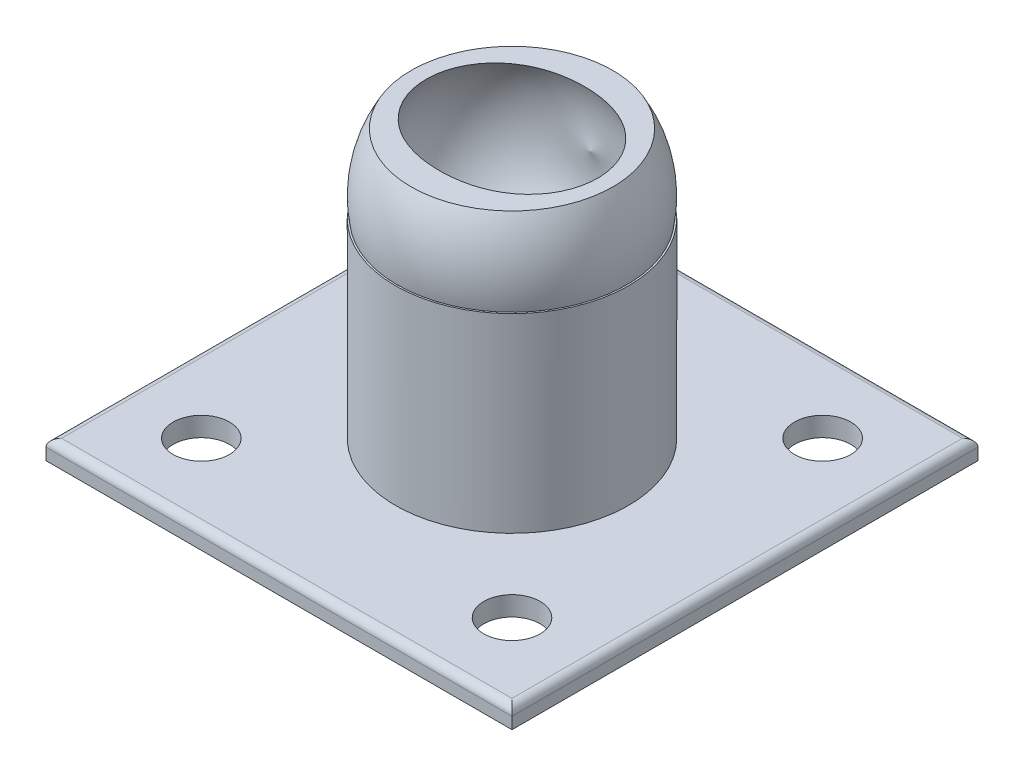
ISO-10303-21;
HEADER;
FILE_DESCRIPTION(('STEP AP214'),'2;1');
FILE_NAME('part.step','',(''),(''),'','','');
FILE_SCHEMA(('AUTOMOTIVE_DESIGN { 1 0 10303 214 1 1 1 1 }'));
ENDSEC;
DATA;
#1=APPLICATION_CONTEXT('core data for automotive mechanical design processes');
#2=APPLICATION_PROTOCOL_DEFINITION('international standard','automotive_design',2000,#1);
#3=PRODUCT_CONTEXT('',#1,'mechanical');
#4=PRODUCT('Part','Part','',(#3));
#5=PRODUCT_RELATED_PRODUCT_CATEGORY('part','',(#4));
#6=PRODUCT_DEFINITION_FORMATION('','',#4);
#7=PRODUCT_DEFINITION_CONTEXT('part definition',#1,'design');
#8=PRODUCT_DEFINITION('design','',#6,#7);
#9=PRODUCT_DEFINITION_SHAPE('','',#8);
#10=(LENGTH_UNIT() NAMED_UNIT(*) SI_UNIT(.MILLI.,.METRE.));
#11=(NAMED_UNIT(*) PLANE_ANGLE_UNIT() SI_UNIT($,.RADIAN.));
#12=(NAMED_UNIT(*) SI_UNIT($,.STERADIAN.) SOLID_ANGLE_UNIT());
#13=UNCERTAINTY_MEASURE_WITH_UNIT(LENGTH_MEASURE(1.E-05),#10,'distance_accuracy_value','');
#14=(GEOMETRIC_REPRESENTATION_CONTEXT(3) GLOBAL_UNCERTAINTY_ASSIGNED_CONTEXT((#13)) GLOBAL_UNIT_ASSIGNED_CONTEXT((#10,
#11,#12)) REPRESENTATION_CONTEXT('',''));
#15=CARTESIAN_POINT('',(0.,0.,0.));
#16=DIRECTION('',(0.,0.,1.));
#17=DIRECTION('',(1.,0.,0.));
#18=AXIS2_PLACEMENT_3D('',#15,#16,#17);
#19=CARTESIAN_POINT('',(0.,59.0365137320334,-3.49148133884313E-12));
#20=DIRECTION('',(0.,0.,-1.));
#21=DIRECTION('',(0.,-1.,0.));
#22=AXIS2_PLACEMENT_3D('',#19,#20,#21);
#23=SPHERICAL_SURFACE('',#22,30.);
#24=CARTESIAN_POINT('',(0.,59.0365137320334,-3.49148133884313E-12));
#25=DIRECTION('',(0.,1.,0.));
#26=DIRECTION('',(0.,0.,1.));
#27=AXIS2_PLACEMENT_3D('',#24,#25,#26);
#28=SPHERICAL_SURFACE('',#27,30.);
#29=CARTESIAN_POINT('',(0.,54.,-3.49148133884313E-12));
#30=DIRECTION('',(0.,1.,0.));
#31=DIRECTION('',(0.,0.,1.));
#32=AXIS2_PLACEMENT_3D('',#29,#30,#31);
#33=CIRCLE('',#32,29.574203783484);
#34=CARTESIAN_POINT('',(0.,54.,29.5742037834805));
#35=VERTEX_POINT('',#34);
#36=EDGE_CURVE('E499',#35,#35,#33,.F.);
#37=ORIENTED_EDGE('',*,*,#36,.F.);
#38=EDGE_LOOP('',(#37));
#39=FACE_BOUND('',#38,.T.);
#40=CARTESIAN_POINT('',(0.,74.0471450811481,-3.49148133884313E-12));
#41=DIRECTION('',(0.,1.,0.));
#42=DIRECTION('',(0.,0.,1.));
#43=AXIS2_PLACEMENT_3D('',#40,#41,#42);
#44=CIRCLE('',#43,25.9746212003366);
#45=CARTESIAN_POINT('',(0.,74.0471450811481,25.9746212003331));
#46=VERTEX_POINT('',#45);
#47=EDGE_CURVE('E497',#46,#46,#44,.T.);
#48=ORIENTED_EDGE('',*,*,#47,.F.);
#49=EDGE_LOOP('',(#48));
#50=FACE_BOUND('',#49,.T.);
#51=ADVANCED_FACE('F425',(#39,#50),#28,.T.);
#52=CARTESIAN_POINT('',(0.,5.,0.));
#53=DIRECTION('',(0.,-1.,0.));
#54=DIRECTION('',(0.,0.,-1.));
#55=AXIS2_PLACEMENT_3D('',#52,#53,#54);
#56=PLANE('',#55);
#57=CARTESIAN_POINT('',(0.,5.,0.));
#58=DIRECTION('',(0.,-1.,0.));
#59=DIRECTION('',(0.,0.,-1.));
#60=AXIS2_PLACEMENT_3D('',#57,#58,#59);
#61=CIRCLE('',#60,30.);
#62=CARTESIAN_POINT('',(0.,5.,-30.));
#63=VERTEX_POINT('',#62);
#64=EDGE_CURVE('E12',#63,#63,#61,.F.);
#65=ORIENTED_EDGE('',*,*,#64,.F.);
#66=EDGE_LOOP('',(#65));
#67=FACE_BOUND('',#66,.T.);
#68=DIRECTION('',(1.,0.,0.));
#69=VECTOR('',#68,1.);
#70=CARTESIAN_POINT('',(0.,5.,58.));
#71=LINE('',#70,#69);
#72=CARTESIAN_POINT('',(-58.,5.,58.));
#73=VERTEX_POINT('',#72);
#74=CARTESIAN_POINT('',(58.,5.,58.));
#75=VERTEX_POINT('',#74);
#76=EDGE_CURVE('E554',#73,#75,#71,.T.);
#77=ORIENTED_EDGE('',*,*,#76,.T.);
#78=DIRECTION('',(0.,0.,-1.));
#79=VECTOR('',#78,1.);
#80=CARTESIAN_POINT('',(58.,5.,0.));
#81=LINE('',#80,#79);
#82=CARTESIAN_POINT('',(58.,5.,-58.));
#83=VERTEX_POINT('',#82);
#84=EDGE_CURVE('E560',#75,#83,#81,.T.);
#85=ORIENTED_EDGE('',*,*,#84,.T.);
#86=DIRECTION('',(-1.,0.,0.));
#87=VECTOR('',#86,1.);
#88=CARTESIAN_POINT('',(0.,5.,-58.));
#89=LINE('',#88,#87);
#90=CARTESIAN_POINT('',(-58.,5.,-58.));
#91=VERTEX_POINT('',#90);
#92=EDGE_CURVE('E558',#83,#91,#89,.T.);
#93=ORIENTED_EDGE('',*,*,#92,.T.);
#94=DIRECTION('',(0.,0.,1.));
#95=VECTOR('',#94,1.);
#96=CARTESIAN_POINT('',(-58.,5.,0.));
#97=LINE('',#96,#95);
#98=EDGE_CURVE('E556',#91,#73,#97,.T.);
#99=ORIENTED_EDGE('',*,*,#98,.T.);
#100=EDGE_LOOP('',(#77,#85,#93,#99));
#101=FACE_BOUND('',#100,.T.);
#102=CARTESIAN_POINT('',(-40.,5.,-40.));
#103=DIRECTION('',(0.,1.,0.));
#104=DIRECTION('',(0.,0.,1.));
#105=AXIS2_PLACEMENT_3D('',#102,#103,#104);
#106=CIRCLE('',#105,7.25);
#107=CARTESIAN_POINT('',(-40.,5.,-32.75));
#108=VERTEX_POINT('',#107);
#109=EDGE_CURVE('E520',#108,#108,#106,.T.);
#110=ORIENTED_EDGE('',*,*,#109,.F.);
#111=EDGE_LOOP('',(#110));
#112=FACE_BOUND('',#111,.T.);
#113=CARTESIAN_POINT('',(39.9999999999997,5.,40.0000000000004));
#114=DIRECTION('',(0.,1.,0.));
#115=DIRECTION('',(0.,0.,1.));
#116=AXIS2_PLACEMENT_3D('',#113,#114,#115);
#117=CIRCLE('',#116,7.25000000000001);
#118=CARTESIAN_POINT('',(39.9999999999997,5.,47.2500000000004));
#119=VERTEX_POINT('',#118);
#120=EDGE_CURVE('E509',#119,#119,#117,.T.);
#121=ORIENTED_EDGE('',*,*,#120,.F.);
#122=EDGE_LOOP('',(#121));
#123=FACE_BOUND('',#122,.T.);
#124=CARTESIAN_POINT('',(-40.,5.,40.));
#125=DIRECTION('',(0.,1.,0.));
#126=DIRECTION('',(0.,0.,-1.));
#127=AXIS2_PLACEMENT_3D('',#124,#125,#126);
#128=CIRCLE('',#127,7.25);
#129=CARTESIAN_POINT('',(-40.,5.,32.75));
#130=VERTEX_POINT('',#129);
#131=EDGE_CURVE('E524',#130,#130,#128,.T.);
#132=ORIENTED_EDGE('',*,*,#131,.F.);
#133=EDGE_LOOP('',(#132));
#134=FACE_BOUND('',#133,.T.);
#135=CARTESIAN_POINT('',(39.9999999999997,5.,-40.0000000000004));
#136=DIRECTION('',(0.,1.,0.));
#137=DIRECTION('',(0.,0.,-1.));
#138=AXIS2_PLACEMENT_3D('',#135,#136,#137);
#139=CIRCLE('',#138,7.25000000000001);
#140=CARTESIAN_POINT('',(39.9999999999997,5.,-47.2500000000004));
#141=VERTEX_POINT('',#140);
#142=EDGE_CURVE('E517',#141,#141,#139,.T.);
#143=ORIENTED_EDGE('',*,*,#142,.F.);
#144=EDGE_LOOP('',(#143));
#145=FACE_BOUND('',#144,.T.);
#146=ADVANCED_FACE('F602',(#67,#101,#112,#123,#134,#145),#56,.F.);
#147=CARTESIAN_POINT('',(0.,0.,0.));
#148=DIRECTION('',(0.,-1.,0.));
#149=DIRECTION('',(0.,0.,-1.));
#150=AXIS2_PLACEMENT_3D('',#147,#148,#149);
#151=PLANE('',#150);
#152=CARTESIAN_POINT('',(-40.,0.,40.));
#153=DIRECTION('',(0.,1.,0.));
#154=DIRECTION('',(0.,0.,-1.));
#155=AXIS2_PLACEMENT_3D('',#152,#153,#154);
#156=CIRCLE('',#155,7.25);
#157=CARTESIAN_POINT('',(-40.,0.,32.75));
#158=VERTEX_POINT('',#157);
#159=EDGE_CURVE('E512',#158,#158,#156,.T.);
#160=ORIENTED_EDGE('',*,*,#159,.T.);
#161=EDGE_LOOP('',(#160));
#162=FACE_BOUND('',#161,.T.);
#163=DIRECTION('',(0.,0.,1.));
#164=VECTOR('',#163,1.);
#165=CARTESIAN_POINT('',(-60.,0.,-60.));
#166=LINE('',#165,#164);
#167=CARTESIAN_POINT('',(-60.,0.,-60.));
#168=VERTEX_POINT('',#167);
#169=CARTESIAN_POINT('',(-60.,0.,60.));
#170=VERTEX_POINT('',#169);
#171=EDGE_CURVE('E532',#168,#170,#166,.T.);
#172=ORIENTED_EDGE('',*,*,#171,.F.);
#173=DIRECTION('',(-1.,0.,0.));
#174=VECTOR('',#173,1.);
#175=CARTESIAN_POINT('',(60.,0.,-60.));
#176=LINE('',#175,#174);
#177=CARTESIAN_POINT('',(60.,0.,-60.));
#178=VERTEX_POINT('',#177);
#179=EDGE_CURVE('E543',#178,#168,#176,.T.);
#180=ORIENTED_EDGE('',*,*,#179,.F.);
#181=DIRECTION('',(0.,0.,-1.));
#182=VECTOR('',#181,1.);
#183=CARTESIAN_POINT('',(60.,0.,-60.));
#184=LINE('',#183,#182);
#185=CARTESIAN_POINT('',(60.,0.,60.));
#186=VERTEX_POINT('',#185);
#187=EDGE_CURVE('E540',#186,#178,#184,.T.);
#188=ORIENTED_EDGE('',*,*,#187,.F.);
#189=DIRECTION('',(1.,0.,0.));
#190=VECTOR('',#189,1.);
#191=CARTESIAN_POINT('',(60.,0.,60.));
#192=LINE('',#191,#190);
#193=EDGE_CURVE('E537',#170,#186,#192,.T.);
#194=ORIENTED_EDGE('',*,*,#193,.F.);
#195=EDGE_LOOP('',(#172,#180,#188,#194));
#196=FACE_BOUND('',#195,.T.);
#197=CARTESIAN_POINT('',(-40.,0.,-40.));
#198=DIRECTION('',(0.,1.,0.));
#199=DIRECTION('',(0.,0.,1.));
#200=AXIS2_PLACEMENT_3D('',#197,#198,#199);
#201=CIRCLE('',#200,7.25);
#202=CARTESIAN_POINT('',(-40.,0.,-32.75));
#203=VERTEX_POINT('',#202);
#204=EDGE_CURVE('E529',#203,#203,#201,.T.);
#205=ORIENTED_EDGE('',*,*,#204,.T.);
#206=EDGE_LOOP('',(#205));
#207=FACE_BOUND('',#206,.T.);
#208=CARTESIAN_POINT('',(39.9999999999997,0.,40.0000000000004));
#209=DIRECTION('',(0.,1.,0.));
#210=DIRECTION('',(0.,0.,1.));
#211=AXIS2_PLACEMENT_3D('',#208,#209,#210);
#212=CIRCLE('',#211,7.25000000000001);
#213=CARTESIAN_POINT('',(39.9999999999997,0.,47.2500000000004));
#214=VERTEX_POINT('',#213);
#215=EDGE_CURVE('E513',#214,#214,#212,.T.);
#216=ORIENTED_EDGE('',*,*,#215,.T.);
#217=EDGE_LOOP('',(#216));
#218=FACE_BOUND('',#217,.T.);
#219=CARTESIAN_POINT('',(39.9999999999997,0.,-40.0000000000004));
#220=DIRECTION('',(0.,1.,0.));
#221=DIRECTION('',(0.,0.,-1.));
#222=AXIS2_PLACEMENT_3D('',#219,#220,#221);
#223=CIRCLE('',#222,7.25000000000001);
#224=CARTESIAN_POINT('',(39.9999999999997,0.,-47.2500000000004));
#225=VERTEX_POINT('',#224);
#226=EDGE_CURVE('E521',#225,#225,#223,.T.);
#227=ORIENTED_EDGE('',*,*,#226,.T.);
#228=EDGE_LOOP('',(#227));
#229=FACE_BOUND('',#228,.T.);
#230=ADVANCED_FACE('F605',(#162,#196,#207,#218,#229),#151,.T.);
#231=CARTESIAN_POINT('',(-60.,5.,-60.));
#232=DIRECTION('',(1.,0.,0.));
#233=DIRECTION('',(0.,0.,-1.));
#234=AXIS2_PLACEMENT_3D('',#231,#232,#233);
#235=PLANE('',#234);
#236=DIRECTION('',(0.,-1.,0.));
#237=VECTOR('',#236,1.);
#238=CARTESIAN_POINT('',(-60.,5.,60.));
#239=LINE('',#238,#237);
#240=CARTESIAN_POINT('',(-60.,3.,60.));
#241=VERTEX_POINT('',#240);
#242=EDGE_CURVE('E552',#241,#170,#239,.T.);
#243=ORIENTED_EDGE('',*,*,#242,.F.);
#244=DIRECTION('',(0.,0.,1.));
#245=VECTOR('',#244,1.);
#246=CARTESIAN_POINT('',(-60.,3.,-60.));
#247=LINE('',#246,#245);
#248=CARTESIAN_POINT('',(-60.,3.,-60.));
#249=VERTEX_POINT('',#248);
#250=EDGE_CURVE('E453',#241,#249,#247,.F.);
#251=ORIENTED_EDGE('',*,*,#250,.T.);
#252=DIRECTION('',(0.,-1.,0.));
#253=VECTOR('',#252,1.);
#254=CARTESIAN_POINT('',(-60.,5.,-60.));
#255=LINE('',#254,#253);
#256=EDGE_CURVE('E546',#249,#168,#255,.T.);
#257=ORIENTED_EDGE('',*,*,#256,.T.);
#258=ORIENTED_EDGE('',*,*,#171,.T.);
#259=EDGE_LOOP('',(#243,#251,#257,#258));
#260=FACE_BOUND('',#259,.T.);
#261=ADVANCED_FACE('F624',(#260),#235,.F.);
#262=CARTESIAN_POINT('',(60.,5.,60.));
#263=DIRECTION('',(0.,0.,-1.));
#264=DIRECTION('',(-1.,0.,0.));
#265=AXIS2_PLACEMENT_3D('',#262,#263,#264);
#266=PLANE('',#265);
#267=DIRECTION('',(0.,-1.,0.));
#268=VECTOR('',#267,1.);
#269=CARTESIAN_POINT('',(60.,5.,60.));
#270=LINE('',#269,#268);
#271=CARTESIAN_POINT('',(60.,3.,60.));
#272=VERTEX_POINT('',#271);
#273=EDGE_CURVE('E550',#272,#186,#270,.T.);
#274=ORIENTED_EDGE('',*,*,#273,.F.);
#275=DIRECTION('',(1.,0.,0.));
#276=VECTOR('',#275,1.);
#277=CARTESIAN_POINT('',(60.,3.,60.));
#278=LINE('',#277,#276);
#279=EDGE_CURVE('E439',#272,#241,#278,.F.);
#280=ORIENTED_EDGE('',*,*,#279,.T.);
#281=ORIENTED_EDGE('',*,*,#242,.T.);
#282=ORIENTED_EDGE('',*,*,#193,.T.);
#283=EDGE_LOOP('',(#274,#280,#281,#282));
#284=FACE_BOUND('',#283,.T.);
#285=ADVANCED_FACE('F630',(#284),#266,.F.);
#286=CARTESIAN_POINT('',(60.,5.,-60.));
#287=DIRECTION('',(-1.,0.,0.));
#288=DIRECTION('',(0.,0.,1.));
#289=AXIS2_PLACEMENT_3D('',#286,#287,#288);
#290=PLANE('',#289);
#291=DIRECTION('',(0.,-1.,0.));
#292=VECTOR('',#291,1.);
#293=CARTESIAN_POINT('',(60.,5.,-60.));
#294=LINE('',#293,#292);
#295=CARTESIAN_POINT('',(60.,3.,-60.));
#296=VERTEX_POINT('',#295);
#297=EDGE_CURVE('E548',#296,#178,#294,.T.);
#298=ORIENTED_EDGE('',*,*,#297,.F.);
#299=DIRECTION('',(0.,0.,-1.));
#300=VECTOR('',#299,1.);
#301=CARTESIAN_POINT('',(60.,3.,-60.));
#302=LINE('',#301,#300);
#303=EDGE_CURVE('E563',#296,#272,#302,.F.);
#304=ORIENTED_EDGE('',*,*,#303,.T.);
#305=ORIENTED_EDGE('',*,*,#273,.T.);
#306=ORIENTED_EDGE('',*,*,#187,.T.);
#307=EDGE_LOOP('',(#298,#304,#305,#306));
#308=FACE_BOUND('',#307,.T.);
#309=ADVANCED_FACE('F595',(#308),#290,.F.);
#310=CARTESIAN_POINT('',(60.,5.,-60.));
#311=DIRECTION('',(0.,0.,1.));
#312=DIRECTION('',(1.,0.,0.));
#313=AXIS2_PLACEMENT_3D('',#310,#311,#312);
#314=PLANE('',#313);
#315=ORIENTED_EDGE('',*,*,#256,.F.);
#316=DIRECTION('',(-1.,0.,0.));
#317=VECTOR('',#316,1.);
#318=CARTESIAN_POINT('',(60.,3.,-60.));
#319=LINE('',#318,#317);
#320=EDGE_CURVE('E566',#249,#296,#319,.F.);
#321=ORIENTED_EDGE('',*,*,#320,.T.);
#322=ORIENTED_EDGE('',*,*,#297,.T.);
#323=ORIENTED_EDGE('',*,*,#179,.T.);
#324=EDGE_LOOP('',(#315,#321,#322,#323));
#325=FACE_BOUND('',#324,.T.);
#326=ADVANCED_FACE('F592',(#325),#314,.F.);
#327=CARTESIAN_POINT('',(-40.,0.,-40.));
#328=DIRECTION('',(0.,1.,0.));
#329=DIRECTION('',(0.,0.,1.));
#330=AXIS2_PLACEMENT_3D('',#327,#328,#329);
#331=CYLINDRICAL_SURFACE('',#330,7.25);
#332=ORIENTED_EDGE('',*,*,#204,.F.);
#333=EDGE_LOOP('',(#332));
#334=FACE_BOUND('',#333,.T.);
#335=ORIENTED_EDGE('',*,*,#109,.T.);
#336=EDGE_LOOP('',(#335));
#337=FACE_BOUND('',#336,.T.);
#338=ADVANCED_FACE('F653',(#334,#337),#331,.F.);
#339=CARTESIAN_POINT('',(39.9999999999997,5.,40.0000000000004));
#340=DIRECTION('',(0.,-1.,0.));
#341=DIRECTION('',(0.,0.,-1.));
#342=AXIS2_PLACEMENT_3D('',#339,#340,#341);
#343=CYLINDRICAL_SURFACE('',#342,7.25000000000001);
#344=ORIENTED_EDGE('',*,*,#120,.T.);
#345=EDGE_LOOP('',(#344));
#346=FACE_BOUND('',#345,.T.);
#347=ORIENTED_EDGE('',*,*,#215,.F.);
#348=EDGE_LOOP('',(#347));
#349=FACE_BOUND('',#348,.T.);
#350=ADVANCED_FACE('F651',(#346,#349),#343,.F.);
#351=CARTESIAN_POINT('',(-40.,5.,40.));
#352=DIRECTION('',(0.,-1.,0.));
#353=DIRECTION('',(0.,0.,-1.));
#354=AXIS2_PLACEMENT_3D('',#351,#352,#353);
#355=CYLINDRICAL_SURFACE('',#354,7.25);
#356=ORIENTED_EDGE('',*,*,#131,.T.);
#357=EDGE_LOOP('',(#356));
#358=FACE_BOUND('',#357,.T.);
#359=ORIENTED_EDGE('',*,*,#159,.F.);
#360=EDGE_LOOP('',(#359));
#361=FACE_BOUND('',#360,.T.);
#362=ADVANCED_FACE('F619',(#358,#361),#355,.F.);
#363=CARTESIAN_POINT('',(39.9999999999997,5.,-40.0000000000004));
#364=DIRECTION('',(0.,-1.,0.));
#365=DIRECTION('',(0.,0.,-1.));
#366=AXIS2_PLACEMENT_3D('',#363,#364,#365);
#367=CYLINDRICAL_SURFACE('',#366,7.25000000000001);
#368=ORIENTED_EDGE('',*,*,#142,.T.);
#369=EDGE_LOOP('',(#368));
#370=FACE_BOUND('',#369,.T.);
#371=ORIENTED_EDGE('',*,*,#226,.F.);
#372=EDGE_LOOP('',(#371));
#373=FACE_BOUND('',#372,.T.);
#374=ADVANCED_FACE('F616',(#370,#373),#367,.F.);
#375=CARTESIAN_POINT('',(-58.,3.,0.));
#376=DIRECTION('',(0.,0.,1.));
#377=DIRECTION('',(1.,0.,0.));
#378=AXIS2_PLACEMENT_3D('',#375,#376,#377);
#379=CYLINDRICAL_SURFACE('',#378,2.);
#380=CARTESIAN_POINT('',(-58.,3.,-58.));
#381=DIRECTION('',(-0.707106781186547,0.,0.707106781186548));
#382=DIRECTION('',(0.707106781186548,0.,0.707106781186547));
#383=AXIS2_PLACEMENT_3D('',#380,#381,#382);
#384=ELLIPSE('',#383,2.82842712474619,2.);
#385=EDGE_CURVE('E573',#249,#91,#384,.F.);
#386=ORIENTED_EDGE('',*,*,#385,.F.);
#387=ORIENTED_EDGE('',*,*,#250,.F.);
#388=CARTESIAN_POINT('',(-58.,3.,58.));
#389=DIRECTION('',(0.707106781186548,0.,0.707106781186547));
#390=DIRECTION('',(0.707106781186547,0.,-0.707106781186548));
#391=AXIS2_PLACEMENT_3D('',#388,#389,#390);
#392=ELLIPSE('',#391,2.82842712474619,2.);
#393=EDGE_CURVE('E516',#73,#241,#392,.T.);
#394=ORIENTED_EDGE('',*,*,#393,.F.);
#395=ORIENTED_EDGE('',*,*,#98,.F.);
#396=EDGE_LOOP('',(#386,#387,#394,#395));
#397=FACE_BOUND('',#396,.T.);
#398=ADVANCED_FACE('F427',(#397),#379,.T.);
#399=CARTESIAN_POINT('',(0.,3.,58.));
#400=DIRECTION('',(1.,0.,0.));
#401=DIRECTION('',(0.,0.,-1.));
#402=AXIS2_PLACEMENT_3D('',#399,#400,#401);
#403=CYLINDRICAL_SURFACE('',#402,2.);
#404=ORIENTED_EDGE('',*,*,#393,.T.);
#405=ORIENTED_EDGE('',*,*,#279,.F.);
#406=CARTESIAN_POINT('',(58.,3.,58.));
#407=DIRECTION('',(0.707106781186547,0.,-0.707106781186548));
#408=DIRECTION('',(0.707106781186548,0.,0.707106781186547));
#409=AXIS2_PLACEMENT_3D('',#406,#407,#408);
#410=ELLIPSE('',#409,2.82842712474619,2.);
#411=EDGE_CURVE('E571',#75,#272,#410,.T.);
#412=ORIENTED_EDGE('',*,*,#411,.F.);
#413=ORIENTED_EDGE('',*,*,#76,.F.);
#414=EDGE_LOOP('',(#404,#405,#412,#413));
#415=FACE_BOUND('',#414,.T.);
#416=ADVANCED_FACE('F580',(#415),#403,.T.);
#417=CARTESIAN_POINT('',(0.,3.,-58.));
#418=DIRECTION('',(-1.,0.,0.));
#419=DIRECTION('',(0.,0.,1.));
#420=AXIS2_PLACEMENT_3D('',#417,#418,#419);
#421=CYLINDRICAL_SURFACE('',#420,2.);
#422=ORIENTED_EDGE('',*,*,#385,.T.);
#423=ORIENTED_EDGE('',*,*,#92,.F.);
#424=CARTESIAN_POINT('',(58.,3.,-58.));
#425=DIRECTION('',(-0.707106781186548,0.,-0.707106781186547));
#426=DIRECTION('',(-0.707106781186547,0.,0.707106781186548));
#427=AXIS2_PLACEMENT_3D('',#424,#425,#426);
#428=ELLIPSE('',#427,2.82842712474619,2.);
#429=EDGE_CURVE('E508',#296,#83,#428,.F.);
#430=ORIENTED_EDGE('',*,*,#429,.F.);
#431=ORIENTED_EDGE('',*,*,#320,.F.);
#432=EDGE_LOOP('',(#422,#423,#430,#431));
#433=FACE_BOUND('',#432,.T.);
#434=ADVANCED_FACE('F589',(#433),#421,.T.);
#435=CARTESIAN_POINT('',(58.,3.,0.));
#436=DIRECTION('',(0.,0.,-1.));
#437=DIRECTION('',(-1.,0.,0.));
#438=AXIS2_PLACEMENT_3D('',#435,#436,#437);
#439=CYLINDRICAL_SURFACE('',#438,2.);
#440=ORIENTED_EDGE('',*,*,#411,.T.);
#441=ORIENTED_EDGE('',*,*,#303,.F.);
#442=ORIENTED_EDGE('',*,*,#429,.T.);
#443=ORIENTED_EDGE('',*,*,#84,.F.);
#444=EDGE_LOOP('',(#440,#441,#442,#443));
#445=FACE_BOUND('',#444,.T.);
#446=ADVANCED_FACE('F599',(#445),#439,.T.);
#447=CARTESIAN_POINT('',(0.,54.,0.));
#448=DIRECTION('',(0.,-1.,0.));
#449=DIRECTION('',(0.,0.,-1.));
#450=AXIS2_PLACEMENT_3D('',#447,#448,#449);
#451=CYLINDRICAL_SURFACE('',#450,30.);
#452=CARTESIAN_POINT('',(0.,54.,0.));
#453=DIRECTION('',(0.,1.,0.));
#454=DIRECTION('',(0.,0.,1.));
#455=AXIS2_PLACEMENT_3D('',#452,#453,#454);
#456=CIRCLE('',#455,30.);
#457=CARTESIAN_POINT('',(0.,54.,30.));
#458=VERTEX_POINT('',#457);
#459=EDGE_CURVE('E504',#458,#458,#456,.T.);
#460=ORIENTED_EDGE('',*,*,#459,.F.);
#461=EDGE_LOOP('',(#460));
#462=FACE_BOUND('',#461,.T.);
#463=ORIENTED_EDGE('',*,*,#64,.T.);
#464=EDGE_LOOP('',(#463));
#465=FACE_BOUND('',#464,.T.);
#466=ADVANCED_FACE('F646',(#462,#465),#451,.T.);
#467=CARTESIAN_POINT('',(0.,54.,0.));
#468=DIRECTION('',(0.,1.,0.));
#469=DIRECTION('',(0.,0.,1.));
#470=AXIS2_PLACEMENT_3D('',#467,#468,#469);
#471=PLANE('',#470);
#472=ORIENTED_EDGE('',*,*,#36,.T.);
#473=EDGE_LOOP('',(#472));
#474=FACE_BOUND('',#473,.T.);
#475=ORIENTED_EDGE('',*,*,#459,.T.);
#476=EDGE_LOOP('',(#475));
#477=FACE_BOUND('',#476,.T.);
#478=ADVANCED_FACE('F643',(#474,#477),#471,.T.);
#479=CARTESIAN_POINT('',(29.2863577086589,74.0471450811481,49.));
#480=DIRECTION('',(0.,1.,0.));
#481=DIRECTION('',(0.,0.,1.));
#482=AXIS2_PLACEMENT_3D('',#479,#480,#481);
#483=PLANE('',#482);
#484=CARTESIAN_POINT('',(0.,74.0471450811481,-18.7271586684848));
#485=CARTESIAN_POINT('',(-0.668017020547555,74.0471450811481,-18.7271677846323));
#486=CARTESIAN_POINT('',(-1.3361612459375,74.0471450811481,-18.705448487345));
#487=CARTESIAN_POINT('',(-2.33599366753405,74.0471450811481,-18.6396788457028));
#488=CARTESIAN_POINT('',(-2.66886534171061,74.0471450811481,-18.6122249753951));
#489=CARTESIAN_POINT('',(-3.3335731781216,74.0471450811481,-18.5459806591432));
#490=CARTESIAN_POINT('',(-3.66540903593192,74.0471450811481,-18.5071871490198));
#491=CARTESIAN_POINT('',(-4.65711902089607,74.0471450811481,-18.3735503373971));
#492=CARTESIAN_POINT('',(-5.3147582076061,74.0471450811481,-18.2613508641152));
#493=CARTESIAN_POINT('',(-6.61961352969084,74.0471450811481,-17.9876728165485));
#494=CARTESIAN_POINT('',(-7.26683200516482,74.0471450811481,-17.8262054731585));
#495=CARTESIAN_POINT('',(-8.47477168951909,74.0471450811481,-17.4718789090981));
#496=CARTESIAN_POINT('',(-9.03710015597965,74.0471450811481,-17.2845165549288));
#497=CARTESIAN_POINT('',(-10.1456114711685,74.0471450811481,-16.8668127037952));
#498=CARTESIAN_POINT('',(-10.6917952898312,74.0471450811481,-16.6364737948706));
#499=CARTESIAN_POINT('',(-11.7635431604292,74.0471450811481,-16.1317583047935));
#500=CARTESIAN_POINT('',(-12.2891058627849,74.0471450811481,-15.8573788473044));
#501=CARTESIAN_POINT('',(-13.3147286834302,74.0471450811481,-15.2643737655402));
#502=CARTESIAN_POINT('',(-13.8147886107276,74.0471450811481,-14.9457478099662));
#503=CARTESIAN_POINT('',(-14.7877775649575,74.0471450811481,-14.2625489839806));
#504=CARTESIAN_POINT('',(-15.2604927697505,74.0471450811481,-13.8976708238779));
#505=CARTESIAN_POINT('',(-16.1698658654619,74.0471450811481,-13.1253480008268));
#506=CARTESIAN_POINT('',(-16.6065226473253,74.0471450811481,-12.7179020294855));
#507=CARTESIAN_POINT('',(-17.4387098316874,74.0471450811481,-11.8630712227956));
#508=CARTESIAN_POINT('',(-17.8342476814913,74.0471450811481,-11.4156936470839));
#509=CARTESIAN_POINT('',(-18.579575338605,74.0471450811481,-10.4843425860008));
#510=CARTESIAN_POINT('',(-18.9293709412479,74.0471450811481,-10.0003737488599));
#511=CARTESIAN_POINT('',(-19.54152121421,74.0471450811481,-9.05769471477934));
#512=CARTESIAN_POINT('',(-19.8093073069024,74.0471450811481,-8.60250227312526));
#513=CARTESIAN_POINT('',(-20.3031705704639,74.0471450811481,-7.67003498691809));
#514=CARTESIAN_POINT('',(-20.5292511106325,74.0471450811481,-7.19276193010915));
#515=CARTESIAN_POINT('',(-20.9373956560506,74.0471450811481,-6.21997486982651));
#516=CARTESIAN_POINT('',(-21.1194773882383,74.0471450811481,-5.72446830558735));
#517=CARTESIAN_POINT('',(-21.4379236096211,74.0471450811481,-4.71897205128857));
#518=CARTESIAN_POINT('',(-21.5742895727118,74.0471450811481,-4.20898282873108));
#519=CARTESIAN_POINT('',(-21.7928794525547,74.0471450811481,-3.21092534578783));
#520=CARTESIAN_POINT('',(-21.8779548417385,74.0471450811481,-2.72347947973877));
#521=CARTESIAN_POINT('',(-22.0059724504332,74.0471450811481,-1.74309884331178));
#522=CARTESIAN_POINT('',(-22.0489167975898,74.0471450811481,-1.25016435138471));
#523=CARTESIAN_POINT('',(-22.0922897221538,74.0471450811481,-0.262494042571195));
#524=CARTESIAN_POINT('',(-22.0927237573203,74.0471450811481,0.232241534923627));
#525=CARTESIAN_POINT('',(-22.0510861811859,74.0471450811481,1.21992293837191));
#526=CARTESIAN_POINT('',(-22.0090145814974,74.0471450811481,1.71286876481429));
#527=CARTESIAN_POINT('',(-21.8839119757449,74.0471450811481,2.6842535287685));
#528=CARTESIAN_POINT('',(-21.8016530701091,74.0471450811481,3.16279213719376));
#529=CARTESIAN_POINT('',(-21.5972594264288,74.0471450811481,4.1112649972871));
#530=CARTESIAN_POINT('',(-21.4751254315889,74.0471450811481,4.5811994091505));
#531=CARTESIAN_POINT('',(-21.1920323742269,74.0471450811481,5.50918401508695));
#532=CARTESIAN_POINT('',(-21.0310758537203,74.0471450811481,5.9672349850882));
#533=CARTESIAN_POINT('',(-20.6716952042626,74.0471450811481,6.86839083576682));
#534=CARTESIAN_POINT('',(-20.4732706674129,74.0471450811481,7.31149555366868));
#535=CARTESIAN_POINT('',(-20.03882937961,74.0471450811481,8.18344317292771));
#536=CARTESIAN_POINT('',(-19.8025157375659,74.0471450811481,8.61213809163636));
#537=CARTESIAN_POINT('',(-19.2954786451245,74.0471450811481,9.4486540068218));
#538=CARTESIAN_POINT('',(-19.0247552226644,74.0471450811481,9.85647502024582));
#539=CARTESIAN_POINT('',(-18.4510967613746,74.0471450811481,10.6488620977415));
#540=CARTESIAN_POINT('',(-18.148157341757,74.0471450811481,11.0334249879506));
#541=CARTESIAN_POINT('',(-17.512548309635,74.0471450811481,11.7771271193175));
#542=CARTESIAN_POINT('',(-17.179878019853,74.0471450811481,12.1362657809699));
#543=CARTESIAN_POINT('',(-16.4743075216509,74.0471450811481,12.8404570041919));
#544=CARTESIAN_POINT('',(-16.1003607625658,74.0471450811481,13.1844606909839));
#545=CARTESIAN_POINT('',(-15.3263427540943,74.0471450811481,13.8416619989739));
#546=CARTESIAN_POINT('',(-14.9262710709906,74.0471450811481,14.1548591085149));
#547=CARTESIAN_POINT('',(-14.1032851978508,74.0471450811481,14.7493089697509));
#548=CARTESIAN_POINT('',(-13.6803782301559,74.0471450811481,15.0305717353205));
#549=CARTESIAN_POINT('',(-12.8147608873353,74.0471450811481,15.5607185740583));
#550=CARTESIAN_POINT('',(-12.3720497447382,74.0471450811481,15.8096013909425));
#551=CARTESIAN_POINT('',(-11.4302800134914,74.0471450811481,16.2953590071756));
#552=CARTESIAN_POINT('',(-10.9296876713099,74.0471450811481,16.5292589192196));
#553=CARTESIAN_POINT('',(-9.91254608226104,74.0471450811481,16.9591802182376));
#554=CARTESIAN_POINT('',(-9.39599624256762,74.0471450811481,17.1552001959923));
#555=CARTESIAN_POINT('',(-8.34967890373035,74.0471450811481,17.5107301955213));
#556=CARTESIAN_POINT('',(-7.819893192919,74.0471450811481,17.6701864475363));
#557=CARTESIAN_POINT('',(-6.75099003461007,74.0471450811481,17.9537550576117));
#558=CARTESIAN_POINT('',(-6.21187157827271,74.0471450811481,18.077863569067));
#559=CARTESIAN_POINT('',(-4.85523398293619,74.0471450811481,18.3462692951662));
#560=CARTESIAN_POINT('',(-4.03347010953847,74.0471450811481,18.4695636255915));
#561=CARTESIAN_POINT('',(-2.79540809013505,74.0471450811481,18.601834021083));
#562=CARTESIAN_POINT('',(-2.38165623817831,74.0471450811481,18.6371491091473));
#563=CARTESIAN_POINT('',(-1.55301847927785,74.0471450811481,18.6906666226277));
#564=CARTESIAN_POINT('',(-1.13813260147991,74.0471450811481,18.7088694837765));
#565=CARTESIAN_POINT('',(-0.307516454721388,74.0471450811481,18.7284362147949));
#566=CARTESIAN_POINT('',(0.108214240235389,74.0471450811481,18.7297813497184));
#567=CARTESIAN_POINT('',(0.939399335051305,74.0471450811481,18.7156050026797));
#568=CARTESIAN_POINT('',(1.35485372936888,74.0471450811481,18.7000831920642));
#569=CARTESIAN_POINT('',(2.18462973643094,74.0471450811481,18.6519534979359));
#570=CARTESIAN_POINT('',(2.59895170715911,74.0471450811481,18.6193518501729));
#571=CARTESIAN_POINT('',(3.42580698778213,74.0471450811481,18.5366249814692));
#572=CARTESIAN_POINT('',(3.83834039384872,74.0471450811481,18.4865007148593));
#573=CARTESIAN_POINT('',(4.90240029846964,74.0471450811481,18.3333416865052));
#574=CARTESIAN_POINT('',(5.55201310922952,74.0471450811481,18.2165210994621));
#575=CARTESIAN_POINT('',(6.8406044416127,74.0471450811481,17.9342698029591));
#576=CARTESIAN_POINT('',(7.4795837016094,74.0471450811481,17.7688424836648));
#577=CARTESIAN_POINT('',(8.74039083535136,74.0471450811481,17.3869952000371));
#578=CARTESIAN_POINT('',(9.36225959011569,74.0471450811481,17.1707112155451));
#579=CARTESIAN_POINT('',(10.5848088548713,74.0471450811481,16.6847408892375));
#580=CARTESIAN_POINT('',(11.1854929306956,74.0471450811481,16.4150635856862));
#581=CARTESIAN_POINT('',(12.2615499407812,74.0471450811481,15.8707070571368));
#582=CARTESIAN_POINT('',(12.7411341435561,74.0471450811481,15.6043376303068));
#583=CARTESIAN_POINT('',(13.6772960724657,74.0471450811481,15.0338165675469));
#584=CARTESIAN_POINT('',(14.1338759720238,74.0471450811481,14.7296685103484));
#585=CARTESIAN_POINT('',(15.0202969433559,74.0471450811481,14.0841160345634));
#586=CARTESIAN_POINT('',(15.4501241628166,74.0471450811481,13.7426925629521));
#587=CARTESIAN_POINT('',(16.2788291571913,74.0471450811481,13.0240791861454));
#588=CARTESIAN_POINT('',(16.6777062678975,74.0471450811481,12.6468885137504));
#589=CARTESIAN_POINT('',(17.4422071515215,74.0471450811481,11.8571511550988));
#590=CARTESIAN_POINT('',(17.8076884328278,74.0471450811481,11.4444663377031));
#591=CARTESIAN_POINT('',(18.4998734483392,74.0471450811481,10.5877203602016));
#592=CARTESIAN_POINT('',(18.826576572456,74.0471450811481,10.1436587066263));
#593=CARTESIAN_POINT('',(19.4377350220385,74.0471450811481,9.2274965876193));
#594=CARTESIAN_POINT('',(19.7222009637048,74.0471450811481,8.75540320978936));
#595=CARTESIAN_POINT('',(20.2459591661917,74.0471450811481,7.7867984833982));
#596=CARTESIAN_POINT('',(20.4852548178632,74.0471450811481,7.29028897124137));
#597=CARTESIAN_POINT('',(20.8990686360459,74.0471450811481,6.31708222254005));
#598=CARTESIAN_POINT('',(21.0772130046635,74.0471450811481,5.84192337654425));
#599=CARTESIAN_POINT('',(21.3913899299159,74.0471450811481,4.87788934818766));
#600=CARTESIAN_POINT('',(21.5274248112092,74.0471450811481,4.38901492462225));
#601=CARTESIAN_POINT('',(21.7560970422554,74.0471450811481,3.401333181227));
#602=CARTESIAN_POINT('',(21.8487440201156,74.0471450811481,2.90252809072485));
#603=CARTESIAN_POINT('',(21.9898190893562,74.0471450811481,1.89870095213692));
#604=CARTESIAN_POINT('',(22.038247819797,74.0471450811481,1.39367899400679));
#605=CARTESIAN_POINT('',(22.0894680770334,74.0471450811481,0.400108980881151));
#606=CARTESIAN_POINT('',(22.0938842531677,74.0471450811481,-0.0883560531948876));
#607=CARTESIAN_POINT('',(22.061261828206,74.0471450811481,-1.06388925791755));
#608=CARTESIAN_POINT('',(22.0242245143022,74.0471450811481,-1.55095747146669));
#609=CARTESIAN_POINT('',(21.9090242591674,74.0471450811481,-2.52015386066545));
#610=CARTESIAN_POINT('',(21.8308653087809,74.0471450811481,-3.00228251107025));
#611=CARTESIAN_POINT('',(21.6341022167662,74.0471450811481,-3.95821396410143));
#612=CARTESIAN_POINT('',(21.5154978748376,74.0471450811481,-4.43201672548272));
#613=CARTESIAN_POINT('',(21.2395798268147,74.0471450811481,-5.36556009482438));
#614=CARTESIAN_POINT('',(21.0824679521438,74.0471450811481,-5.82536040281518));
#615=CARTESIAN_POINT('',(20.7305634113163,74.0471450811481,-6.73029512292779));
#616=CARTESIAN_POINT('',(20.5357710965002,74.0471450811481,-7.17542967175095));
#617=CARTESIAN_POINT('',(20.1101339330569,74.0471450811481,-8.04812396240864));
#618=CARTESIAN_POINT('',(19.8792877733281,74.0471450811481,-8.47568306439573));
#619=CARTESIAN_POINT('',(19.3834620703856,74.0471450811481,-9.31052096282056));
#620=CARTESIAN_POINT('',(19.118481970581,74.0471450811481,-9.71779942841035));
#621=CARTESIAN_POINT('',(18.5506472148373,74.0471450811481,-10.5179737363145));
#622=CARTESIAN_POINT('',(18.2471140737993,74.0471450811481,-10.9103879624113));
#623=CARTESIAN_POINT('',(17.6092524861424,74.0471450811481,-11.6693090976249));
#624=CARTESIAN_POINT('',(17.2749238440065,74.0471450811481,-12.0358158422322));
#625=CARTESIAN_POINT('',(16.5782151165563,74.0471450811481,-12.7410309602228));
#626=CARTESIAN_POINT('',(16.2158373663714,74.0471450811481,-13.0797416428427));
#627=CARTESIAN_POINT('',(15.4658512800338,74.0471450811481,-13.7279480348724));
#628=CARTESIAN_POINT('',(15.0782421454133,74.0471450811481,-14.0374428189612));
#629=CARTESIAN_POINT('',(14.2578271519073,74.0471450811481,-14.6430831610837));
#630=CARTESIAN_POINT('',(13.8237040950315,74.0471450811481,-14.9374437926696));
#631=CARTESIAN_POINT('',(12.9340089235122,74.0471450811481,-15.4916619481046));
#632=CARTESIAN_POINT('',(12.4784365008625,74.0471450811481,-15.7515189762879));
#633=CARTESIAN_POINT('',(11.5490924633721,74.0471450811481,-16.2367041395269));
#634=CARTESIAN_POINT('',(11.0753140520788,74.0471450811481,-16.4620192200481));
#635=CARTESIAN_POINT('',(10.1128711268151,74.0471450811481,-16.8784669527425));
#636=CARTESIAN_POINT('',(9.62420338781665,74.0471450811481,-17.0695921368957));
#637=CARTESIAN_POINT('',(8.76502592092807,74.0471450811481,-17.372670086109));
#638=CARTESIAN_POINT('',(8.39717454312558,74.0471450811481,-17.4922354988354));
#639=CARTESIAN_POINT('',(7.6562987833298,74.0471450811481,-17.7136966489661));
#640=CARTESIAN_POINT('',(7.2832753755373,74.0471450811481,-17.8155956664562));
#641=CARTESIAN_POINT('',(6.15742433760464,74.0471450811481,-18.0957727739739));
#642=CARTESIAN_POINT('',(5.39805077495414,74.0471450811481,-18.2484492130083));
#643=CARTESIAN_POINT('',(4.25093133750596,74.0471450811481,-18.4298289830597));
#644=CARTESIAN_POINT('',(3.86669301732327,74.0471450811481,-18.4823882236403));
#645=CARTESIAN_POINT('',(3.09642123236885,74.0471450811481,-18.5720548112716));
#646=CARTESIAN_POINT('',(2.71038795141832,74.0471450811481,-18.6091637068161));
#647=CARTESIAN_POINT('',(1.93723803918783,74.0471450811481,-18.6683486939575));
#648=CARTESIAN_POINT('',(1.55012157374301,74.0471450811481,-18.6904269724846));
#649=CARTESIAN_POINT('',(0.77535102142558,74.0471450811481,-18.7198293238613));
#650=CARTESIAN_POINT('',(0.387696933862613,74.0471450811481,-18.7271533777477));
#651=CARTESIAN_POINT('',(0.,74.0471450811481,-18.7271586684848));
#652=B_SPLINE_CURVE_WITH_KNOTS('',3,(#484,#485,#486,#487,#488,#489,#490,#491,#492,#493,#494,
#495,#496,#497,#498,#499,#500,#501,#502,#503,#504,#505,#506,#507,#508,#509,#510,#511,#512,#513,
#514,#515,#516,#517,#518,#519,#520,#521,#522,#523,#524,#525,#526,#527,#528,#529,#530,#531,#532,
#533,#534,#535,#536,#537,#538,#539,#540,#541,#542,#543,#544,#545,#546,#547,#548,#549,#550,#551,
#552,#553,#554,#555,#556,#557,#558,#559,#560,#561,#562,#563,#564,#565,#566,#567,#568,#569,#570,
#571,#572,#573,#574,#575,#576,#577,#578,#579,#580,#581,#582,#583,#584,#585,#586,#587,#588,#589,
#590,#591,#592,#593,#594,#595,#596,#597,#598,#599,#600,#601,#602,#603,#604,#605,#606,#607,#608,
#609,#610,#611,#612,#613,#614,#615,#616,#617,#618,#619,#620,#621,#622,#623,#624,#625,#626,#627,
#628,#629,#630,#631,#632,#633,#634,#635,#636,#637,#638,#639,#640,#641,#642,#643,#644,#645,#646,
#647,#648,#649,#650,#651),.UNSPECIFIED.,.T.,.F.,(4,2,2,2,2,2,2,2,2,2,2,2,2,2,2,2,2,2,2,2,2,2,2,
2,2,2,2,2,2,2,2,2,2,2,2,2,2,2,2,2,2,2,2,2,2,2,2,2,2,2,2,2,2,2,2,2,2,2,2,2,2,2,2,2,2,2,2,2,2,2,2,
2,2,2,2,2,2,2,2,2,2,2,2,4),(0.,2.00380024564722,3.00564913993535,4.0077690028828,
6.00732136490231,8.00641825754355,9.7829342320591,11.5593432596381,13.335868353681,
15.1124067503053,16.9013498290365,18.6903479101148,20.479021408055,22.267468069254,
23.8497865696903,25.4319771820672,27.0135292695364,28.5950303621958,30.0776759516398,
31.5602466626405,33.0426270310164,34.5250069944147,35.9799645879542,37.4348950650836,
38.8897303023444,40.3445813787027,41.8114460243052,43.2783094789625,44.7453726559666,
46.2124692616139,47.7351383232083,49.2578326700748,50.7800482085881,52.3023227887367,
53.9583073217407,55.6143534492579,57.2728195203576,58.9314659998381,61.4205538000607,
62.6660659252399,63.9115463347819,65.1584107946584,66.4052995501758,67.651733390722,
68.8980993575623,70.8763686294066,72.8544999559723,74.8274011479621,76.7999686581309,
78.444084606575,80.0880449281933,81.7328495160745,83.3776893926865,85.0292482408253,
86.6808330691298,88.3320020708018,89.9830470729065,91.5035232077286,93.0239153895421,
94.5439700246615,96.0640026909728,97.5277084161178,98.9913686922937,100.454886946801,
101.918412449295,103.374425260937,104.830424497062,106.28647669308,107.742552634614,
109.229204844947,110.715866494507,112.202404510145,113.688989591381,115.260873321323,
116.832779629912,118.405278556617,119.978120542341,121.138062338966,122.297788540244,
124.617984223801,125.781213843381,126.944326851462,128.107270592309,129.270215827857),.UNSPECIFIED.);
#653=CARTESIAN_POINT('',(0.,74.0471450811481,-18.7271586684848));
#654=VERTEX_POINT('',#653);
#655=EDGE_CURVE('E429',#654,#654,#652,.T.);
#656=ORIENTED_EDGE('',*,*,#655,.F.);
#657=EDGE_LOOP('',(#656));
#658=FACE_BOUND('',#657,.T.);
#659=ORIENTED_EDGE('',*,*,#47,.T.);
#660=EDGE_LOOP('',(#659));
#661=FACE_BOUND('',#660,.T.);
#662=ADVANCED_FACE('F492',(#658,#661),#483,.T.);
#663=CARTESIAN_POINT('',(5.86336181335967,59.0365137320334,2.26596704360015E-13));
#664=DIRECTION('',(0.,-1.,0.));
#665=DIRECTION('',(1.,0.,0.));
#666=AXIS2_PLACEMENT_3D('',#663,#664,#665);
#667=CIRCLE('',#666,20.8417612440591);
#668=TRIMMED_CURVE('',#667,(PARAMETER_VALUE(-1.85597358926361)),
(PARAMETER_VALUE(1.85597358926361)),.T.,.PARAMETER.);
#669=CARTESIAN_POINT('',(0.,59.0365137320334,2.26596704360015E-13));
#670=DIRECTION('',(0.,0.,1.));
#671=AXIS1_PLACEMENT('',#669,#670);
#672=SURFACE_OF_REVOLUTION('',#668,#671);
#673=CARTESIAN_POINT('',(0.,59.0365137320334,-20.));
#674=VERTEX_POINT('',#673);
#675=VERTEX_LOOP('',#674);
#676=FACE_BOUND('',#675,.T.);
#677=CARTESIAN_POINT('',(0.,59.0365137320334,20.));
#678=VERTEX_POINT('',#677);
#679=VERTEX_LOOP('',#678);
#680=FACE_BOUND('',#679,.T.);
#681=ORIENTED_EDGE('',*,*,#655,.T.);
#682=EDGE_LOOP('',(#681));
#683=FACE_BOUND('',#682,.T.);
#684=ADVANCED_FACE('F489',(#676,#680,#683),#672,.F.);
#685=CLOSED_SHELL('',(#51,#146,#230,#261,#285,#309,#326,#338,#350,#362,#374,#398,#416,#434,#446,
#466,#478,#662,#684));
#686=MANIFOLD_SOLID_BREP('B2',#685);
#687=ADVANCED_BREP_SHAPE_REPRESENTATION('',(#18,#686),#14);
#688=SHAPE_DEFINITION_REPRESENTATION(#9,#687);
ENDSEC;
END-ISO-10303-21;
